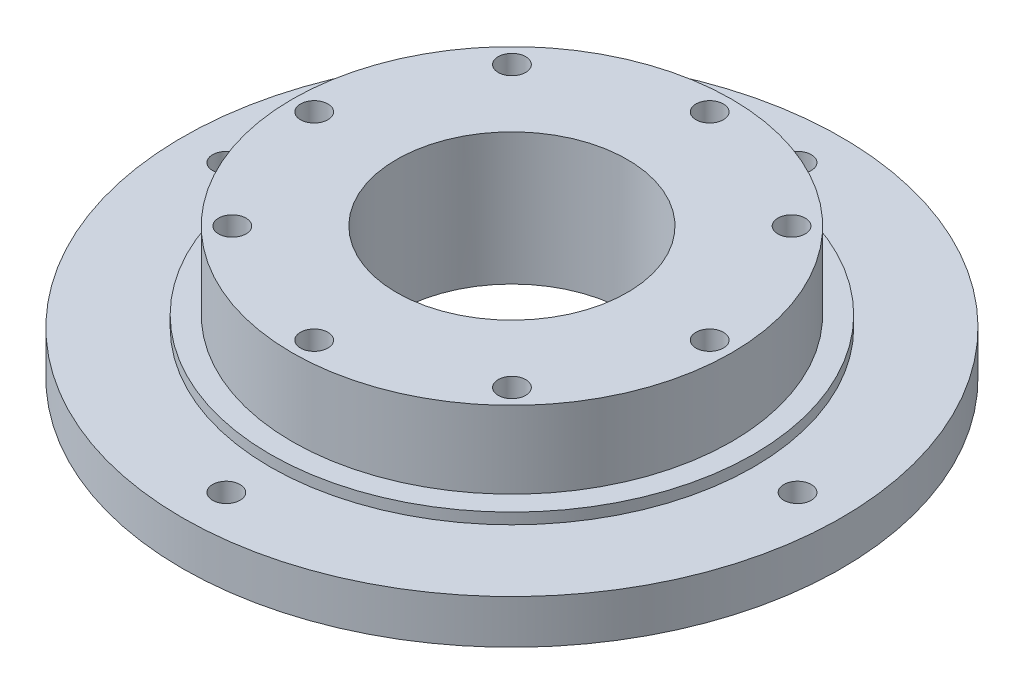
ISO-10303-21;
HEADER;
FILE_DESCRIPTION(('STEP AP214'),'2;1');
FILE_NAME('part.step','',(''),(''),'','','');
FILE_SCHEMA(('AUTOMOTIVE_DESIGN { 1 0 10303 214 1 1 1 1 }'));
ENDSEC;
DATA;
#1=APPLICATION_CONTEXT('core data for automotive mechanical design processes');
#2=APPLICATION_PROTOCOL_DEFINITION('international standard','automotive_design',2000,#1);
#3=PRODUCT_CONTEXT('',#1,'mechanical');
#4=PRODUCT('Part','Part','',(#3));
#5=PRODUCT_RELATED_PRODUCT_CATEGORY('part','',(#4));
#6=PRODUCT_DEFINITION_FORMATION('','',#4);
#7=PRODUCT_DEFINITION_CONTEXT('part definition',#1,'design');
#8=PRODUCT_DEFINITION('design','',#6,#7);
#9=PRODUCT_DEFINITION_SHAPE('','',#8);
#10=(LENGTH_UNIT() NAMED_UNIT(*) SI_UNIT(.MILLI.,.METRE.));
#11=(NAMED_UNIT(*) PLANE_ANGLE_UNIT() SI_UNIT($,.RADIAN.));
#12=(NAMED_UNIT(*) SI_UNIT($,.STERADIAN.) SOLID_ANGLE_UNIT());
#13=UNCERTAINTY_MEASURE_WITH_UNIT(LENGTH_MEASURE(1.E-05),#10,'distance_accuracy_value','');
#14=(GEOMETRIC_REPRESENTATION_CONTEXT(3) GLOBAL_UNCERTAINTY_ASSIGNED_CONTEXT((#13)) GLOBAL_UNIT_ASSIGNED_CONTEXT((#10,
#11,#12)) REPRESENTATION_CONTEXT('',''));
#15=CARTESIAN_POINT('',(0.,0.,0.));
#16=DIRECTION('',(0.,0.,1.));
#17=DIRECTION('',(1.,0.,0.));
#18=AXIS2_PLACEMENT_3D('',#15,#16,#17);
#19=CARTESIAN_POINT('',(0.,-4.,0.));
#20=DIRECTION('',(0.,1.,0.));
#21=DIRECTION('',(0.,0.,1.));
#22=AXIS2_PLACEMENT_3D('',#19,#20,#21);
#23=CYLINDRICAL_SURFACE('',#22,30.);
#24=CARTESIAN_POINT('',(0.,-4.,0.));
#25=DIRECTION('',(0.,1.,0.));
#26=DIRECTION('',(0.,0.,1.));
#27=AXIS2_PLACEMENT_3D('',#24,#25,#26);
#28=CIRCLE('',#27,30.);
#29=CARTESIAN_POINT('',(0.,-4.,30.));
#30=VERTEX_POINT('',#29);
#31=EDGE_CURVE('E192',#30,#30,#28,.T.);
#32=ORIENTED_EDGE('',*,*,#31,.T.);
#33=EDGE_LOOP('',(#32));
#34=FACE_BOUND('',#33,.T.);
#35=CARTESIAN_POINT('',(0.,0.,0.));
#36=DIRECTION('',(0.,1.,0.));
#37=DIRECTION('',(0.,0.,1.));
#38=AXIS2_PLACEMENT_3D('',#35,#36,#37);
#39=CIRCLE('',#38,30.);
#40=CARTESIAN_POINT('',(0.,0.,30.));
#41=VERTEX_POINT('',#40);
#42=EDGE_CURVE('E188',#41,#41,#39,.T.);
#43=ORIENTED_EDGE('',*,*,#42,.F.);
#44=EDGE_LOOP('',(#43));
#45=FACE_BOUND('',#44,.T.);
#46=ADVANCED_FACE('F60',(#34,#45),#23,.T.);
#47=CARTESIAN_POINT('',(0.,-4.,0.));
#48=DIRECTION('',(0.,1.,0.));
#49=DIRECTION('',(0.,0.,1.));
#50=AXIS2_PLACEMENT_3D('',#47,#48,#49);
#51=PLANE('',#50);
#52=CARTESIAN_POINT('',(0.,-4.,26.));
#53=DIRECTION('',(0.,-1.,0.));
#54=DIRECTION('',(0.,0.,-1.));
#55=AXIS2_PLACEMENT_3D('',#52,#53,#54);
#56=CIRCLE('',#55,1.25);
#57=CARTESIAN_POINT('',(0.,-4.,24.75));
#58=VERTEX_POINT('',#57);
#59=EDGE_CURVE('E227',#58,#58,#56,.T.);
#60=ORIENTED_EDGE('',*,*,#59,.F.);
#61=EDGE_LOOP('',(#60));
#62=FACE_BOUND('',#61,.T.);
#63=CARTESIAN_POINT('',(26.0000000000007,-4.,7.34188322673829E-13));
#64=DIRECTION('',(0.,-1.,0.));
#65=DIRECTION('',(0.,0.,-1.));
#66=AXIS2_PLACEMENT_3D('',#63,#64,#65);
#67=CIRCLE('',#66,1.25);
#68=CARTESIAN_POINT('',(26.0000000000007,-4.,-1.24999999999926));
#69=VERTEX_POINT('',#68);
#70=EDGE_CURVE('E210',#69,#69,#67,.T.);
#71=ORIENTED_EDGE('',*,*,#70,.F.);
#72=EDGE_LOOP('',(#71));
#73=FACE_BOUND('',#72,.T.);
#74=CARTESIAN_POINT('',(1.46837664534766E-12,-4.,-26.));
#75=DIRECTION('',(0.,-1.,0.));
#76=DIRECTION('',(0.,0.,-1.));
#77=AXIS2_PLACEMENT_3D('',#74,#75,#76);
#78=CIRCLE('',#77,1.25);
#79=CARTESIAN_POINT('',(1.46837664534766E-12,-4.,-27.25));
#80=VERTEX_POINT('',#79);
#81=EDGE_CURVE('E206',#80,#80,#78,.T.);
#82=ORIENTED_EDGE('',*,*,#81,.F.);
#83=EDGE_LOOP('',(#82));
#84=FACE_BOUND('',#83,.T.);
#85=CARTESIAN_POINT('',(-25.9999999999993,-4.,-7.31004240996046E-13));
#86=DIRECTION('',(0.,-1.,0.));
#87=DIRECTION('',(0.,0.,-1.));
#88=AXIS2_PLACEMENT_3D('',#85,#86,#87);
#89=CIRCLE('',#88,1.25);
#90=CARTESIAN_POINT('',(-25.9999999999993,-4.,-1.25000000000073));
#91=VERTEX_POINT('',#90);
#92=EDGE_CURVE('E202',#91,#91,#89,.T.);
#93=ORIENTED_EDGE('',*,*,#92,.F.);
#94=EDGE_LOOP('',(#93));
#95=FACE_BOUND('',#94,.T.);
#96=CARTESIAN_POINT('',(0.,-4.,0.));
#97=DIRECTION('',(0.,-1.,0.));
#98=DIRECTION('',(0.,0.,-1.));
#99=AXIS2_PLACEMENT_3D('',#96,#97,#98);
#100=CIRCLE('',#99,10.5);
#101=CARTESIAN_POINT('',(0.,-4.,-10.5));
#102=VERTEX_POINT('',#101);
#103=EDGE_CURVE('E172',#102,#102,#100,.T.);
#104=ORIENTED_EDGE('',*,*,#103,.F.);
#105=EDGE_LOOP('',(#104));
#106=FACE_BOUND('',#105,.T.);
#107=ORIENTED_EDGE('',*,*,#31,.F.);
#108=EDGE_LOOP('',(#107));
#109=FACE_BOUND('',#108,.T.);
#110=ADVANCED_FACE('F237',(#62,#73,#84,#95,#106,#109),#51,.F.);
#111=CARTESIAN_POINT('',(0.,0.,0.));
#112=DIRECTION('',(0.,1.,0.));
#113=DIRECTION('',(0.,0.,1.));
#114=AXIS2_PLACEMENT_3D('',#111,#112,#113);
#115=PLANE('',#114);
#116=CARTESIAN_POINT('',(0.,0.,26.));
#117=DIRECTION('',(0.,1.,0.));
#118=DIRECTION('',(0.,0.,1.));
#119=AXIS2_PLACEMENT_3D('',#116,#117,#118);
#120=CIRCLE('',#119,1.25);
#121=CARTESIAN_POINT('',(0.,0.,27.25));
#122=VERTEX_POINT('',#121);
#123=EDGE_CURVE('E63',#122,#122,#120,.T.);
#124=ORIENTED_EDGE('',*,*,#123,.F.);
#125=EDGE_LOOP('',(#124));
#126=FACE_BOUND('',#125,.T.);
#127=CARTESIAN_POINT('',(26.0000000000007,0.,7.34188322673829E-13));
#128=DIRECTION('',(0.,1.,0.));
#129=DIRECTION('',(0.,0.,1.));
#130=AXIS2_PLACEMENT_3D('',#127,#128,#129);
#131=CIRCLE('',#130,1.25);
#132=CARTESIAN_POINT('',(26.0000000000007,0.,1.25000000000073));
#133=VERTEX_POINT('',#132);
#134=EDGE_CURVE('E207',#133,#133,#131,.T.);
#135=ORIENTED_EDGE('',*,*,#134,.F.);
#136=EDGE_LOOP('',(#135));
#137=FACE_BOUND('',#136,.T.);
#138=CARTESIAN_POINT('',(1.46837664534766E-12,0.,-26.));
#139=DIRECTION('',(0.,1.,0.));
#140=DIRECTION('',(0.,0.,1.));
#141=AXIS2_PLACEMENT_3D('',#138,#139,#140);
#142=CIRCLE('',#141,1.25);
#143=CARTESIAN_POINT('',(1.46837664534766E-12,0.,-24.75));
#144=VERTEX_POINT('',#143);
#145=EDGE_CURVE('E203',#144,#144,#142,.T.);
#146=ORIENTED_EDGE('',*,*,#145,.F.);
#147=EDGE_LOOP('',(#146));
#148=FACE_BOUND('',#147,.T.);
#149=CARTESIAN_POINT('',(-25.9999999999993,0.,-7.31004240996046E-13));
#150=DIRECTION('',(0.,1.,0.));
#151=DIRECTION('',(0.,0.,1.));
#152=AXIS2_PLACEMENT_3D('',#149,#150,#151);
#153=CIRCLE('',#152,1.25);
#154=CARTESIAN_POINT('',(-25.9999999999993,0.,1.24999999999927));
#155=VERTEX_POINT('',#154);
#156=EDGE_CURVE('E117',#155,#155,#153,.T.);
#157=ORIENTED_EDGE('',*,*,#156,.F.);
#158=EDGE_LOOP('',(#157));
#159=FACE_BOUND('',#158,.T.);
#160=CARTESIAN_POINT('',(0.,0.,0.));
#161=DIRECTION('',(0.,1.,0.));
#162=DIRECTION('',(0.,0.,1.));
#163=AXIS2_PLACEMENT_3D('',#160,#161,#162);
#164=CIRCLE('',#163,22.);
#165=CARTESIAN_POINT('',(0.,0.,22.));
#166=VERTEX_POINT('',#165);
#167=EDGE_CURVE('E69',#166,#166,#164,.T.);
#168=ORIENTED_EDGE('',*,*,#167,.F.);
#169=EDGE_LOOP('',(#168));
#170=FACE_BOUND('',#169,.T.);
#171=ORIENTED_EDGE('',*,*,#42,.T.);
#172=EDGE_LOOP('',(#171));
#173=FACE_BOUND('',#172,.T.);
#174=ADVANCED_FACE('F240',(#126,#137,#148,#159,#170,#173),#115,.T.);
#175=CARTESIAN_POINT('',(0.,1.,0.));
#176=DIRECTION('',(0.,-1.,0.));
#177=DIRECTION('',(0.,0.,-1.));
#178=AXIS2_PLACEMENT_3D('',#175,#176,#177);
#179=CYLINDRICAL_SURFACE('',#178,22.);
#180=CARTESIAN_POINT('',(0.,1.,0.));
#181=DIRECTION('',(0.,1.,0.));
#182=DIRECTION('',(0.,0.,1.));
#183=AXIS2_PLACEMENT_3D('',#180,#181,#182);
#184=CIRCLE('',#183,22.);
#185=CARTESIAN_POINT('',(0.,1.,22.));
#186=VERTEX_POINT('',#185);
#187=EDGE_CURVE('E183',#186,#186,#184,.T.);
#188=ORIENTED_EDGE('',*,*,#187,.F.);
#189=EDGE_LOOP('',(#188));
#190=FACE_BOUND('',#189,.T.);
#191=ORIENTED_EDGE('',*,*,#167,.T.);
#192=EDGE_LOOP('',(#191));
#193=FACE_BOUND('',#192,.T.);
#194=ADVANCED_FACE('F252',(#190,#193),#179,.T.);
#195=CARTESIAN_POINT('',(0.,1.,0.));
#196=DIRECTION('',(0.,1.,0.));
#197=DIRECTION('',(0.,0.,1.));
#198=AXIS2_PLACEMENT_3D('',#195,#196,#197);
#199=PLANE('',#198);
#200=CARTESIAN_POINT('',(0.,1.,0.));
#201=DIRECTION('',(0.,1.,0.));
#202=DIRECTION('',(0.,0.,1.));
#203=AXIS2_PLACEMENT_3D('',#200,#201,#202);
#204=CIRCLE('',#203,20.);
#205=CARTESIAN_POINT('',(0.,1.,20.));
#206=VERTEX_POINT('',#205);
#207=EDGE_CURVE('E13',#206,#206,#204,.T.);
#208=ORIENTED_EDGE('',*,*,#207,.F.);
#209=EDGE_LOOP('',(#208));
#210=FACE_BOUND('',#209,.T.);
#211=ORIENTED_EDGE('',*,*,#187,.T.);
#212=EDGE_LOOP('',(#211));
#213=FACE_BOUND('',#212,.T.);
#214=ADVANCED_FACE('F257',(#210,#213),#199,.T.);
#215=CARTESIAN_POINT('',(0.,8.,0.));
#216=DIRECTION('',(0.,-1.,0.));
#217=DIRECTION('',(0.,0.,-1.));
#218=AXIS2_PLACEMENT_3D('',#215,#216,#217);
#219=CYLINDRICAL_SURFACE('',#218,20.);
#220=CARTESIAN_POINT('',(0.,8.,0.));
#221=DIRECTION('',(0.,1.,0.));
#222=DIRECTION('',(0.,0.,1.));
#223=AXIS2_PLACEMENT_3D('',#220,#221,#222);
#224=CIRCLE('',#223,20.);
#225=CARTESIAN_POINT('',(0.,8.,20.));
#226=VERTEX_POINT('',#225);
#227=EDGE_CURVE('E180',#226,#226,#224,.T.);
#228=ORIENTED_EDGE('',*,*,#227,.F.);
#229=EDGE_LOOP('',(#228));
#230=FACE_BOUND('',#229,.T.);
#231=ORIENTED_EDGE('',*,*,#207,.T.);
#232=EDGE_LOOP('',(#231));
#233=FACE_BOUND('',#232,.T.);
#234=ADVANCED_FACE('F265',(#230,#233),#219,.T.);
#235=CARTESIAN_POINT('',(0.,8.,0.));
#236=DIRECTION('',(0.,1.,0.));
#237=DIRECTION('',(0.,0.,1.));
#238=AXIS2_PLACEMENT_3D('',#235,#236,#237);
#239=PLANE('',#238);
#240=CARTESIAN_POINT('',(18.,8.,0.));
#241=DIRECTION('',(0.,1.,0.));
#242=DIRECTION('',(0.,0.,1.));
#243=AXIS2_PLACEMENT_3D('',#240,#241,#242);
#244=CIRCLE('',#243,1.25);
#245=CARTESIAN_POINT('',(18.,8.,1.25));
#246=VERTEX_POINT('',#245);
#247=EDGE_CURVE('E107',#246,#246,#244,.T.);
#248=ORIENTED_EDGE('',*,*,#247,.F.);
#249=EDGE_LOOP('',(#248));
#250=FACE_BOUND('',#249,.T.);
#251=CARTESIAN_POINT('',(12.7279220613578,8.,12.7279220613579));
#252=DIRECTION('',(0.,1.,0.));
#253=DIRECTION('',(0.,0.,1.));
#254=AXIS2_PLACEMENT_3D('',#251,#252,#253);
#255=CIRCLE('',#254,1.25);
#256=CARTESIAN_POINT('',(12.7279220613578,8.,13.9779220613579));
#257=VERTEX_POINT('',#256);
#258=EDGE_CURVE('E106',#257,#257,#255,.T.);
#259=ORIENTED_EDGE('',*,*,#258,.F.);
#260=EDGE_LOOP('',(#259));
#261=FACE_BOUND('',#260,.T.);
#262=CARTESIAN_POINT('',(0.,8.,18.));
#263=DIRECTION('',(0.,1.,0.));
#264=DIRECTION('',(0.,0.,1.));
#265=AXIS2_PLACEMENT_3D('',#262,#263,#264);
#266=CIRCLE('',#265,1.25);
#267=CARTESIAN_POINT('',(0.,8.,19.25));
#268=VERTEX_POINT('',#267);
#269=EDGE_CURVE('E124',#268,#268,#266,.T.);
#270=ORIENTED_EDGE('',*,*,#269,.F.);
#271=EDGE_LOOP('',(#270));
#272=FACE_BOUND('',#271,.T.);
#273=CARTESIAN_POINT('',(-12.7279220613579,8.,12.7279220613578));
#274=DIRECTION('',(0.,1.,0.));
#275=DIRECTION('',(0.,0.,1.));
#276=AXIS2_PLACEMENT_3D('',#273,#274,#275);
#277=CIRCLE('',#276,1.25);
#278=CARTESIAN_POINT('',(-12.7279220613579,8.,13.9779220613578));
#279=VERTEX_POINT('',#278);
#280=EDGE_CURVE('E132',#279,#279,#277,.T.);
#281=ORIENTED_EDGE('',*,*,#280,.F.);
#282=EDGE_LOOP('',(#281));
#283=FACE_BOUND('',#282,.T.);
#284=CARTESIAN_POINT('',(-18.,8.,-1.25693328198353E-13));
#285=DIRECTION('',(0.,1.,0.));
#286=DIRECTION('',(0.,0.,1.));
#287=AXIS2_PLACEMENT_3D('',#284,#285,#286);
#288=CIRCLE('',#287,1.25);
#289=CARTESIAN_POINT('',(-18.,8.,1.24999999999987));
#290=VERTEX_POINT('',#289);
#291=EDGE_CURVE('E140',#290,#290,#288,.T.);
#292=ORIENTED_EDGE('',*,*,#291,.F.);
#293=EDGE_LOOP('',(#292));
#294=FACE_BOUND('',#293,.T.);
#295=CARTESIAN_POINT('',(-12.7279220613577,8.,-12.727922061358));
#296=DIRECTION('',(0.,1.,0.));
#297=DIRECTION('',(0.,0.,1.));
#298=AXIS2_PLACEMENT_3D('',#295,#296,#297);
#299=CIRCLE('',#298,1.25);
#300=CARTESIAN_POINT('',(-12.7279220613577,8.,-11.477922061358));
#301=VERTEX_POINT('',#300);
#302=EDGE_CURVE('E148',#301,#301,#299,.T.);
#303=ORIENTED_EDGE('',*,*,#302,.F.);
#304=EDGE_LOOP('',(#303));
#305=FACE_BOUND('',#304,.T.);
#306=CARTESIAN_POINT('',(1.88539992297529E-13,8.,-18.));
#307=DIRECTION('',(0.,1.,0.));
#308=DIRECTION('',(0.,0.,1.));
#309=AXIS2_PLACEMENT_3D('',#306,#307,#308);
#310=CIRCLE('',#309,1.25);
#311=CARTESIAN_POINT('',(1.88539992297529E-13,8.,-16.75));
#312=VERTEX_POINT('',#311);
#313=EDGE_CURVE('E156',#312,#312,#310,.T.);
#314=ORIENTED_EDGE('',*,*,#313,.F.);
#315=EDGE_LOOP('',(#314));
#316=FACE_BOUND('',#315,.T.);
#317=CARTESIAN_POINT('',(12.727922061358,8.,-12.7279220613577));
#318=DIRECTION('',(0.,1.,0.));
#319=DIRECTION('',(0.,0.,1.));
#320=AXIS2_PLACEMENT_3D('',#317,#318,#319);
#321=CIRCLE('',#320,1.25);
#322=CARTESIAN_POINT('',(12.727922061358,8.,-11.4779220613577));
#323=VERTEX_POINT('',#322);
#324=EDGE_CURVE('E164',#323,#323,#321,.T.);
#325=ORIENTED_EDGE('',*,*,#324,.F.);
#326=EDGE_LOOP('',(#325));
#327=FACE_BOUND('',#326,.T.);
#328=CARTESIAN_POINT('',(0.,8.,0.));
#329=DIRECTION('',(0.,1.,0.));
#330=DIRECTION('',(0.,0.,1.));
#331=AXIS2_PLACEMENT_3D('',#328,#329,#330);
#332=CIRCLE('',#331,10.5);
#333=CARTESIAN_POINT('',(0.,8.,10.5));
#334=VERTEX_POINT('',#333);
#335=EDGE_CURVE('E176',#334,#334,#332,.T.);
#336=ORIENTED_EDGE('',*,*,#335,.F.);
#337=EDGE_LOOP('',(#336));
#338=FACE_BOUND('',#337,.T.);
#339=ORIENTED_EDGE('',*,*,#227,.T.);
#340=EDGE_LOOP('',(#339));
#341=FACE_BOUND('',#340,.T.);
#342=ADVANCED_FACE('F269',(#250,#261,#272,#283,#294,#305,#316,#327,#338,#341),#239,.T.);
#343=CARTESIAN_POINT('',(0.,3.,0.));
#344=DIRECTION('',(0.,1.,0.));
#345=DIRECTION('',(0.,0.,1.));
#346=AXIS2_PLACEMENT_3D('',#343,#344,#345);
#347=CYLINDRICAL_SURFACE('',#346,10.5);
#348=ORIENTED_EDGE('',*,*,#335,.T.);
#349=EDGE_LOOP('',(#348));
#350=FACE_BOUND('',#349,.T.);
#351=ORIENTED_EDGE('',*,*,#103,.T.);
#352=EDGE_LOOP('',(#351));
#353=FACE_BOUND('',#352,.T.);
#354=ADVANCED_FACE('F273',(#350,#353),#347,.F.);
#355=CARTESIAN_POINT('',(12.727922061358,1.25107577378445,-12.7279220613577));
#356=DIRECTION('',(0.,1.,0.));
#357=DIRECTION('',(0.,0.,1.));
#358=AXIS2_PLACEMENT_3D('',#355,#356,#357);
#359=CONICAL_SURFACE('',#358,1.25,1.02974425867665);
#360=CARTESIAN_POINT('',(12.727922061358,0.5,-12.7279220613577));
#361=VERTEX_POINT('',#360);
#362=VERTEX_LOOP('',#361);
#363=FACE_BOUND('',#362,.T.);
#364=CARTESIAN_POINT('',(12.727922061358,1.25107577378445,-12.7279220613577));
#365=DIRECTION('',(0.,1.,0.));
#366=DIRECTION('',(0.,0.,1.));
#367=AXIS2_PLACEMENT_3D('',#364,#365,#366);
#368=CIRCLE('',#367,1.25);
#369=CARTESIAN_POINT('',(12.727922061358,1.25107577378445,-11.4779220613577));
#370=VERTEX_POINT('',#369);
#371=EDGE_CURVE('E168',#370,#370,#368,.T.);
#372=ORIENTED_EDGE('',*,*,#371,.T.);
#373=EDGE_LOOP('',(#372));
#374=FACE_BOUND('',#373,.T.);
#375=ADVANCED_FACE('F277',(#363,#374),#359,.F.);
#376=CARTESIAN_POINT('',(12.727922061358,8.,-12.7279220613577));
#377=DIRECTION('',(0.,1.,0.));
#378=DIRECTION('',(0.,0.,1.));
#379=AXIS2_PLACEMENT_3D('',#376,#377,#378);
#380=CYLINDRICAL_SURFACE('',#379,1.25);
#381=ORIENTED_EDGE('',*,*,#371,.F.);
#382=EDGE_LOOP('',(#381));
#383=FACE_BOUND('',#382,.T.);
#384=ORIENTED_EDGE('',*,*,#324,.T.);
#385=EDGE_LOOP('',(#384));
#386=FACE_BOUND('',#385,.T.);
#387=ADVANCED_FACE('F281',(#383,#386),#380,.F.);
#388=CARTESIAN_POINT('',(1.88539992297529E-13,1.25107577378445,-18.));
#389=DIRECTION('',(0.,1.,0.));
#390=DIRECTION('',(0.,0.,1.));
#391=AXIS2_PLACEMENT_3D('',#388,#389,#390);
#392=CONICAL_SURFACE('',#391,1.25,1.02974425867665);
#393=CARTESIAN_POINT('',(1.86805268821552E-13,0.5,-18.));
#394=VERTEX_POINT('',#393);
#395=VERTEX_LOOP('',#394);
#396=FACE_BOUND('',#395,.T.);
#397=CARTESIAN_POINT('',(1.88539992297529E-13,1.25107577378445,-18.));
#398=DIRECTION('',(0.,1.,0.));
#399=DIRECTION('',(0.,0.,1.));
#400=AXIS2_PLACEMENT_3D('',#397,#398,#399);
#401=CIRCLE('',#400,1.25);
#402=CARTESIAN_POINT('',(1.88539992297529E-13,1.25107577378445,-16.75));
#403=VERTEX_POINT('',#402);
#404=EDGE_CURVE('E160',#403,#403,#401,.T.);
#405=ORIENTED_EDGE('',*,*,#404,.T.);
#406=EDGE_LOOP('',(#405));
#407=FACE_BOUND('',#406,.T.);
#408=ADVANCED_FACE('F284',(#396,#407),#392,.F.);
#409=CARTESIAN_POINT('',(1.88539992297529E-13,8.,-18.));
#410=DIRECTION('',(0.,1.,0.));
#411=DIRECTION('',(0.,0.,1.));
#412=AXIS2_PLACEMENT_3D('',#409,#410,#411);
#413=CYLINDRICAL_SURFACE('',#412,1.25);
#414=ORIENTED_EDGE('',*,*,#404,.F.);
#415=EDGE_LOOP('',(#414));
#416=FACE_BOUND('',#415,.T.);
#417=ORIENTED_EDGE('',*,*,#313,.T.);
#418=EDGE_LOOP('',(#417));
#419=FACE_BOUND('',#418,.T.);
#420=ADVANCED_FACE('F288',(#416,#419),#413,.F.);
#421=CARTESIAN_POINT('',(-12.7279220613577,1.25107577378445,-12.727922061358));
#422=DIRECTION('',(0.,1.,0.));
#423=DIRECTION('',(0.,0.,1.));
#424=AXIS2_PLACEMENT_3D('',#421,#422,#423);
#425=CONICAL_SURFACE('',#424,1.25,1.02974425867665);
#426=CARTESIAN_POINT('',(-12.7279220613577,0.5,-12.727922061358));
#427=VERTEX_POINT('',#426);
#428=VERTEX_LOOP('',#427);
#429=FACE_BOUND('',#428,.T.);
#430=CARTESIAN_POINT('',(-12.7279220613577,1.25107577378445,-12.727922061358));
#431=DIRECTION('',(0.,1.,0.));
#432=DIRECTION('',(0.,0.,1.));
#433=AXIS2_PLACEMENT_3D('',#430,#431,#432);
#434=CIRCLE('',#433,1.25);
#435=CARTESIAN_POINT('',(-12.7279220613577,1.25107577378445,-11.477922061358));
#436=VERTEX_POINT('',#435);
#437=EDGE_CURVE('E152',#436,#436,#434,.T.);
#438=ORIENTED_EDGE('',*,*,#437,.T.);
#439=EDGE_LOOP('',(#438));
#440=FACE_BOUND('',#439,.T.);
#441=ADVANCED_FACE('F291',(#429,#440),#425,.F.);
#442=CARTESIAN_POINT('',(-12.7279220613577,8.,-12.727922061358));
#443=DIRECTION('',(0.,1.,0.));
#444=DIRECTION('',(0.,0.,1.));
#445=AXIS2_PLACEMENT_3D('',#442,#443,#444);
#446=CYLINDRICAL_SURFACE('',#445,1.25);
#447=ORIENTED_EDGE('',*,*,#437,.F.);
#448=EDGE_LOOP('',(#447));
#449=FACE_BOUND('',#448,.T.);
#450=ORIENTED_EDGE('',*,*,#302,.T.);
#451=EDGE_LOOP('',(#450));
#452=FACE_BOUND('',#451,.T.);
#453=ADVANCED_FACE('F295',(#449,#452),#446,.F.);
#454=CARTESIAN_POINT('',(-18.,1.25107577378445,-1.25693328198353E-13));
#455=DIRECTION('',(0.,1.,0.));
#456=DIRECTION('',(0.,0.,1.));
#457=AXIS2_PLACEMENT_3D('',#454,#455,#456);
#458=CONICAL_SURFACE('',#457,1.25,1.02974425867665);
#459=CARTESIAN_POINT('',(-18.,0.5,-1.25693328198353E-13));
#460=VERTEX_POINT('',#459);
#461=VERTEX_LOOP('',#460);
#462=FACE_BOUND('',#461,.T.);
#463=CARTESIAN_POINT('',(-18.,1.25107577378445,-1.25693328198353E-13));
#464=DIRECTION('',(0.,1.,0.));
#465=DIRECTION('',(0.,0.,1.));
#466=AXIS2_PLACEMENT_3D('',#463,#464,#465);
#467=CIRCLE('',#466,1.25);
#468=CARTESIAN_POINT('',(-18.,1.25107577378445,1.24999999999987));
#469=VERTEX_POINT('',#468);
#470=EDGE_CURVE('E144',#469,#469,#467,.T.);
#471=ORIENTED_EDGE('',*,*,#470,.T.);
#472=EDGE_LOOP('',(#471));
#473=FACE_BOUND('',#472,.T.);
#474=ADVANCED_FACE('F299',(#462,#473),#458,.F.);
#475=CARTESIAN_POINT('',(-18.,8.,-1.25693328198353E-13));
#476=DIRECTION('',(0.,1.,0.));
#477=DIRECTION('',(0.,0.,1.));
#478=AXIS2_PLACEMENT_3D('',#475,#476,#477);
#479=CYLINDRICAL_SURFACE('',#478,1.25);
#480=ORIENTED_EDGE('',*,*,#470,.F.);
#481=EDGE_LOOP('',(#480));
#482=FACE_BOUND('',#481,.T.);
#483=ORIENTED_EDGE('',*,*,#291,.T.);
#484=EDGE_LOOP('',(#483));
#485=FACE_BOUND('',#484,.T.);
#486=ADVANCED_FACE('F303',(#482,#485),#479,.F.);
#487=CARTESIAN_POINT('',(-12.7279220613579,1.25107577378445,12.7279220613578));
#488=DIRECTION('',(0.,1.,0.));
#489=DIRECTION('',(0.,0.,1.));
#490=AXIS2_PLACEMENT_3D('',#487,#488,#489);
#491=CONICAL_SURFACE('',#490,1.25,1.02974425867665);
#492=CARTESIAN_POINT('',(-12.7279220613579,0.5,12.7279220613578));
#493=VERTEX_POINT('',#492);
#494=VERTEX_LOOP('',#493);
#495=FACE_BOUND('',#494,.T.);
#496=CARTESIAN_POINT('',(-12.7279220613579,1.25107577378445,12.7279220613578));
#497=DIRECTION('',(0.,1.,0.));
#498=DIRECTION('',(0.,0.,1.));
#499=AXIS2_PLACEMENT_3D('',#496,#497,#498);
#500=CIRCLE('',#499,1.25);
#501=CARTESIAN_POINT('',(-12.7279220613579,1.25107577378445,13.9779220613578));
#502=VERTEX_POINT('',#501);
#503=EDGE_CURVE('E136',#502,#502,#500,.T.);
#504=ORIENTED_EDGE('',*,*,#503,.T.);
#505=EDGE_LOOP('',(#504));
#506=FACE_BOUND('',#505,.T.);
#507=ADVANCED_FACE('F307',(#495,#506),#491,.F.);
#508=CARTESIAN_POINT('',(-12.7279220613579,8.,12.7279220613578));
#509=DIRECTION('',(0.,1.,0.));
#510=DIRECTION('',(0.,0.,1.));
#511=AXIS2_PLACEMENT_3D('',#508,#509,#510);
#512=CYLINDRICAL_SURFACE('',#511,1.25);
#513=ORIENTED_EDGE('',*,*,#503,.F.);
#514=EDGE_LOOP('',(#513));
#515=FACE_BOUND('',#514,.T.);
#516=ORIENTED_EDGE('',*,*,#280,.T.);
#517=EDGE_LOOP('',(#516));
#518=FACE_BOUND('',#517,.T.);
#519=ADVANCED_FACE('F311',(#515,#518),#512,.F.);
#520=CARTESIAN_POINT('',(0.,1.25107577378445,18.));
#521=DIRECTION('',(0.,1.,0.));
#522=DIRECTION('',(0.,0.,1.));
#523=AXIS2_PLACEMENT_3D('',#520,#521,#522);
#524=CONICAL_SURFACE('',#523,1.25,1.02974425867665);
#525=CARTESIAN_POINT('',(0.,0.5,18.));
#526=VERTEX_POINT('',#525);
#527=VERTEX_LOOP('',#526);
#528=FACE_BOUND('',#527,.T.);
#529=CARTESIAN_POINT('',(0.,1.25107577378445,18.));
#530=DIRECTION('',(0.,1.,0.));
#531=DIRECTION('',(0.,0.,1.));
#532=AXIS2_PLACEMENT_3D('',#529,#530,#531);
#533=CIRCLE('',#532,1.25);
#534=CARTESIAN_POINT('',(0.,1.25107577378445,19.25));
#535=VERTEX_POINT('',#534);
#536=EDGE_CURVE('E128',#535,#535,#533,.T.);
#537=ORIENTED_EDGE('',*,*,#536,.T.);
#538=EDGE_LOOP('',(#537));
#539=FACE_BOUND('',#538,.T.);
#540=ADVANCED_FACE('F315',(#528,#539),#524,.F.);
#541=CARTESIAN_POINT('',(0.,8.,18.));
#542=DIRECTION('',(0.,1.,0.));
#543=DIRECTION('',(0.,0.,1.));
#544=AXIS2_PLACEMENT_3D('',#541,#542,#543);
#545=CYLINDRICAL_SURFACE('',#544,1.25);
#546=ORIENTED_EDGE('',*,*,#536,.F.);
#547=EDGE_LOOP('',(#546));
#548=FACE_BOUND('',#547,.T.);
#549=ORIENTED_EDGE('',*,*,#269,.T.);
#550=EDGE_LOOP('',(#549));
#551=FACE_BOUND('',#550,.T.);
#552=ADVANCED_FACE('F319',(#548,#551),#545,.F.);
#553=CARTESIAN_POINT('',(12.7279220613578,1.25107577378445,12.7279220613579));
#554=DIRECTION('',(0.,1.,0.));
#555=DIRECTION('',(0.,0.,1.));
#556=AXIS2_PLACEMENT_3D('',#553,#554,#555);
#557=CONICAL_SURFACE('',#556,1.25,1.02974425867665);
#558=CARTESIAN_POINT('',(12.7279220613578,0.5,12.7279220613579));
#559=VERTEX_POINT('',#558);
#560=VERTEX_LOOP('',#559);
#561=FACE_BOUND('',#560,.T.);
#562=CARTESIAN_POINT('',(12.7279220613578,1.25107577378445,12.7279220613579));
#563=DIRECTION('',(0.,1.,0.));
#564=DIRECTION('',(0.,0.,1.));
#565=AXIS2_PLACEMENT_3D('',#562,#563,#564);
#566=CIRCLE('',#565,1.25);
#567=CARTESIAN_POINT('',(12.7279220613578,1.25107577378445,13.9779220613579));
#568=VERTEX_POINT('',#567);
#569=EDGE_CURVE('E114',#568,#568,#566,.T.);
#570=ORIENTED_EDGE('',*,*,#569,.T.);
#571=EDGE_LOOP('',(#570));
#572=FACE_BOUND('',#571,.T.);
#573=ADVANCED_FACE('F323',(#561,#572),#557,.F.);
#574=CARTESIAN_POINT('',(12.7279220613578,8.,12.7279220613579));
#575=DIRECTION('',(0.,1.,0.));
#576=DIRECTION('',(0.,0.,1.));
#577=AXIS2_PLACEMENT_3D('',#574,#575,#576);
#578=CYLINDRICAL_SURFACE('',#577,1.25);
#579=ORIENTED_EDGE('',*,*,#569,.F.);
#580=EDGE_LOOP('',(#579));
#581=FACE_BOUND('',#580,.T.);
#582=ORIENTED_EDGE('',*,*,#258,.T.);
#583=EDGE_LOOP('',(#582));
#584=FACE_BOUND('',#583,.T.);
#585=ADVANCED_FACE('F99',(#581,#584),#578,.F.);
#586=CARTESIAN_POINT('',(18.,1.25107577378445,0.));
#587=DIRECTION('',(0.,1.,0.));
#588=DIRECTION('',(0.,0.,1.));
#589=AXIS2_PLACEMENT_3D('',#586,#587,#588);
#590=CONICAL_SURFACE('',#589,1.25,1.02974425867665);
#591=CARTESIAN_POINT('',(18.,0.5,0.));
#592=VERTEX_POINT('',#591);
#593=VERTEX_LOOP('',#592);
#594=FACE_BOUND('',#593,.T.);
#595=CARTESIAN_POINT('',(18.,1.25107577378445,0.));
#596=DIRECTION('',(0.,1.,0.));
#597=DIRECTION('',(0.,0.,1.));
#598=AXIS2_PLACEMENT_3D('',#595,#596,#597);
#599=CIRCLE('',#598,1.25);
#600=CARTESIAN_POINT('',(18.,1.25107577378445,1.25));
#601=VERTEX_POINT('',#600);
#602=EDGE_CURVE('E103',#601,#601,#599,.T.);
#603=ORIENTED_EDGE('',*,*,#602,.T.);
#604=EDGE_LOOP('',(#603));
#605=FACE_BOUND('',#604,.T.);
#606=ADVANCED_FACE('F95',(#594,#605),#590,.F.);
#607=CARTESIAN_POINT('',(18.,8.,0.));
#608=DIRECTION('',(0.,1.,0.));
#609=DIRECTION('',(0.,0.,1.));
#610=AXIS2_PLACEMENT_3D('',#607,#608,#609);
#611=CYLINDRICAL_SURFACE('',#610,1.25);
#612=ORIENTED_EDGE('',*,*,#602,.F.);
#613=EDGE_LOOP('',(#612));
#614=FACE_BOUND('',#613,.T.);
#615=ORIENTED_EDGE('',*,*,#247,.T.);
#616=EDGE_LOOP('',(#615));
#617=FACE_BOUND('',#616,.T.);
#618=ADVANCED_FACE('F98',(#614,#617),#611,.F.);
#619=CARTESIAN_POINT('',(-25.9999999999993,-4.,-7.31004240996046E-13));
#620=DIRECTION('',(0.,-1.,0.));
#621=DIRECTION('',(0.,0.,-1.));
#622=AXIS2_PLACEMENT_3D('',#619,#620,#621);
#623=CYLINDRICAL_SURFACE('',#622,1.25);
#624=ORIENTED_EDGE('',*,*,#156,.T.);
#625=EDGE_LOOP('',(#624));
#626=FACE_BOUND('',#625,.T.);
#627=ORIENTED_EDGE('',*,*,#92,.T.);
#628=EDGE_LOOP('',(#627));
#629=FACE_BOUND('',#628,.T.);
#630=ADVANCED_FACE('F235',(#626,#629),#623,.F.);
#631=CARTESIAN_POINT('',(1.46837664534766E-12,-4.,-26.));
#632=DIRECTION('',(0.,-1.,0.));
#633=DIRECTION('',(0.,0.,-1.));
#634=AXIS2_PLACEMENT_3D('',#631,#632,#633);
#635=CYLINDRICAL_SURFACE('',#634,1.25);
#636=ORIENTED_EDGE('',*,*,#145,.T.);
#637=EDGE_LOOP('',(#636));
#638=FACE_BOUND('',#637,.T.);
#639=ORIENTED_EDGE('',*,*,#81,.T.);
#640=EDGE_LOOP('',(#639));
#641=FACE_BOUND('',#640,.T.);
#642=ADVANCED_FACE('F335',(#638,#641),#635,.F.);
#643=CARTESIAN_POINT('',(26.0000000000007,-4.,7.34188322673829E-13));
#644=DIRECTION('',(0.,-1.,0.));
#645=DIRECTION('',(0.,0.,-1.));
#646=AXIS2_PLACEMENT_3D('',#643,#644,#645);
#647=CYLINDRICAL_SURFACE('',#646,1.25);
#648=ORIENTED_EDGE('',*,*,#134,.T.);
#649=EDGE_LOOP('',(#648));
#650=FACE_BOUND('',#649,.T.);
#651=ORIENTED_EDGE('',*,*,#70,.T.);
#652=EDGE_LOOP('',(#651));
#653=FACE_BOUND('',#652,.T.);
#654=ADVANCED_FACE('F339',(#650,#653),#647,.F.);
#655=CARTESIAN_POINT('',(0.,-4.,26.));
#656=DIRECTION('',(0.,-1.,0.));
#657=DIRECTION('',(0.,0.,-1.));
#658=AXIS2_PLACEMENT_3D('',#655,#656,#657);
#659=CYLINDRICAL_SURFACE('',#658,1.25);
#660=ORIENTED_EDGE('',*,*,#123,.T.);
#661=EDGE_LOOP('',(#660));
#662=FACE_BOUND('',#661,.T.);
#663=ORIENTED_EDGE('',*,*,#59,.T.);
#664=EDGE_LOOP('',(#663));
#665=FACE_BOUND('',#664,.T.);
#666=ADVANCED_FACE('F343',(#662,#665),#659,.F.);
#667=CLOSED_SHELL('',(#46,#110,#174,#194,#214,#234,#342,#354,#375,#387,#408,#420,#441,#453,#474,
#486,#507,#519,#540,#552,#573,#585,#606,#618,#630,#642,#654,#666));
#668=MANIFOLD_SOLID_BREP('B2',#667);
#669=ADVANCED_BREP_SHAPE_REPRESENTATION('',(#18,#668),#14);
#670=SHAPE_DEFINITION_REPRESENTATION(#9,#669);
ENDSEC;
END-ISO-10303-21;
